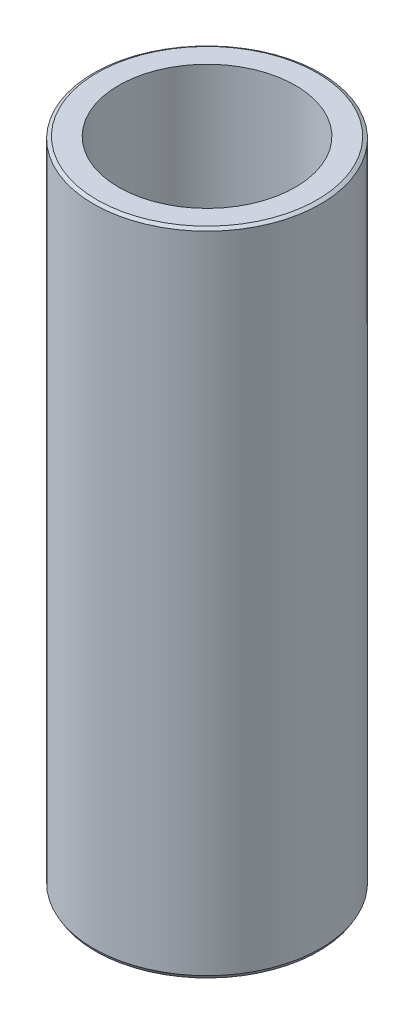
ISO-10303-21;
HEADER;
FILE_DESCRIPTION(('STEP AP214'),'2;1');
FILE_NAME('part.step','',(''),(''),'','','');
FILE_SCHEMA(('AUTOMOTIVE_DESIGN { 1 0 10303 214 1 1 1 1 }'));
ENDSEC;
DATA;
#1=APPLICATION_CONTEXT('core data for automotive mechanical design processes');
#2=APPLICATION_PROTOCOL_DEFINITION('international standard','automotive_design',2000,#1);
#3=PRODUCT_CONTEXT('',#1,'mechanical');
#4=PRODUCT('Part','Part','',(#3));
#5=PRODUCT_RELATED_PRODUCT_CATEGORY('part','',(#4));
#6=PRODUCT_DEFINITION_FORMATION('','',#4);
#7=PRODUCT_DEFINITION_CONTEXT('part definition',#1,'design');
#8=PRODUCT_DEFINITION('design','',#6,#7);
#9=PRODUCT_DEFINITION_SHAPE('','',#8);
#10=(LENGTH_UNIT() NAMED_UNIT(*) SI_UNIT(.MILLI.,.METRE.));
#11=(NAMED_UNIT(*) PLANE_ANGLE_UNIT() SI_UNIT($,.RADIAN.));
#12=(NAMED_UNIT(*) SI_UNIT($,.STERADIAN.) SOLID_ANGLE_UNIT());
#13=UNCERTAINTY_MEASURE_WITH_UNIT(LENGTH_MEASURE(1.E-05),#10,'distance_accuracy_value','');
#14=(GEOMETRIC_REPRESENTATION_CONTEXT(3) GLOBAL_UNCERTAINTY_ASSIGNED_CONTEXT((#13)) GLOBAL_UNIT_ASSIGNED_CONTEXT((#10,
#11,#12)) REPRESENTATION_CONTEXT('',''));
#15=CARTESIAN_POINT('',(0.,0.,0.));
#16=DIRECTION('',(0.,0.,1.));
#17=DIRECTION('',(1.,0.,0.));
#18=AXIS2_PLACEMENT_3D('',#15,#16,#17);
#19=CARTESIAN_POINT('',(0.,100.26764990413,0.));
#20=DIRECTION('',(0.,-1.,0.));
#21=DIRECTION('',(0.,0.,-1.));
#22=AXIS2_PLACEMENT_3D('',#19,#20,#21);
#23=CYLINDRICAL_SURFACE('',#22,17.5);
#24=CARTESIAN_POINT('',(0.,99.96493620214,0.));
#25=DIRECTION('',(0.,1.,0.));
#26=DIRECTION('',(0.,0.,1.));
#27=AXIS2_PLACEMENT_3D('',#24,#25,#26);
#28=CIRCLE('',#27,17.5);
#29=CARTESIAN_POINT('',(0.,99.96493620214,17.5));
#30=VERTEX_POINT('',#29);
#31=EDGE_CURVE('E50',#30,#30,#28,.F.);
#32=ORIENTED_EDGE('',*,*,#31,.T.);
#33=EDGE_LOOP('',(#32));
#34=FACE_BOUND('',#33,.T.);
#35=CARTESIAN_POINT('',(0.,0.52431551199375,0.));
#36=DIRECTION('',(0.,1.,0.));
#37=DIRECTION('',(0.,0.,1.));
#38=AXIS2_PLACEMENT_3D('',#35,#36,#37);
#39=CIRCLE('',#38,17.5);
#40=CARTESIAN_POINT('',(0.,0.52431551199375,17.5));
#41=VERTEX_POINT('',#40);
#42=EDGE_CURVE('E51',#41,#41,#39,.T.);
#43=ORIENTED_EDGE('',*,*,#42,.T.);
#44=EDGE_LOOP('',(#43));
#45=FACE_BOUND('',#44,.T.);
#46=ADVANCED_FACE('F39',(#34,#45),#23,.T.);
#47=CARTESIAN_POINT('',(0.,100.26764990413,0.));
#48=DIRECTION('',(0.,1.,0.));
#49=DIRECTION('',(0.,0.,1.));
#50=AXIS2_PLACEMENT_3D('',#47,#48,#49);
#51=PLANE('',#50);
#52=CARTESIAN_POINT('',(0.,100.26764990413,0.));
#53=DIRECTION('',(0.,1.,0.));
#54=DIRECTION('',(0.,0.,1.));
#55=AXIS2_PLACEMENT_3D('',#52,#53,#54);
#56=CIRCLE('',#55,16.9756844880063);
#57=CARTESIAN_POINT('',(0.,100.26764990413,16.9756844880063));
#58=VERTEX_POINT('',#57);
#59=EDGE_CURVE('E54',#58,#58,#56,.T.);
#60=ORIENTED_EDGE('',*,*,#59,.T.);
#61=EDGE_LOOP('',(#60));
#62=FACE_BOUND('',#61,.T.);
#63=CARTESIAN_POINT('',(0.,100.26764990413,0.));
#64=DIRECTION('',(0.,1.,0.));
#65=DIRECTION('',(0.,0.,1.));
#66=AXIS2_PLACEMENT_3D('',#63,#64,#65);
#67=CIRCLE('',#66,13.621903189217);
#68=CARTESIAN_POINT('',(0.,100.26764990413,13.621903189217));
#69=VERTEX_POINT('',#68);
#70=EDGE_CURVE('E58',#69,#69,#67,.T.);
#71=ORIENTED_EDGE('',*,*,#70,.F.);
#72=EDGE_LOOP('',(#71));
#73=FACE_BOUND('',#72,.T.);
#74=ADVANCED_FACE('F69',(#62,#73),#51,.T.);
#75=CARTESIAN_POINT('',(0.,0.,0.));
#76=DIRECTION('',(0.,1.,0.));
#77=DIRECTION('',(0.,0.,1.));
#78=AXIS2_PLACEMENT_3D('',#75,#76,#77);
#79=PLANE('',#78);
#80=CARTESIAN_POINT('',(0.,0.,0.));
#81=DIRECTION('',(0.,1.,0.));
#82=DIRECTION('',(0.,0.,1.));
#83=AXIS2_PLACEMENT_3D('',#80,#81,#82);
#84=CIRCLE('',#83,17.1972862980101);
#85=CARTESIAN_POINT('',(0.,0.,17.1972862980101));
#86=VERTEX_POINT('',#85);
#87=EDGE_CURVE('E10',#86,#86,#84,.F.);
#88=ORIENTED_EDGE('',*,*,#87,.T.);
#89=EDGE_LOOP('',(#88));
#90=FACE_BOUND('',#89,.T.);
#91=CARTESIAN_POINT('',(0.,0.,0.));
#92=DIRECTION('',(0.,1.,0.));
#93=DIRECTION('',(0.,0.,1.));
#94=AXIS2_PLACEMENT_3D('',#91,#92,#93);
#95=CIRCLE('',#94,13.621903189217);
#96=CARTESIAN_POINT('',(0.,0.,13.621903189217));
#97=VERTEX_POINT('',#96);
#98=EDGE_CURVE('E63',#97,#97,#95,.T.);
#99=ORIENTED_EDGE('',*,*,#98,.T.);
#100=EDGE_LOOP('',(#99));
#101=FACE_BOUND('',#100,.T.);
#102=ADVANCED_FACE('F75',(#90,#101),#79,.F.);
#103=CARTESIAN_POINT('',(0.,100.26764990413,0.));
#104=DIRECTION('',(0.,-1.,0.));
#105=DIRECTION('',(0.,0.,-1.));
#106=AXIS2_PLACEMENT_3D('',#103,#104,#105);
#107=CYLINDRICAL_SURFACE('',#106,13.621903189217);
#108=ORIENTED_EDGE('',*,*,#70,.T.);
#109=EDGE_LOOP('',(#108));
#110=FACE_BOUND('',#109,.T.);
#111=ORIENTED_EDGE('',*,*,#98,.F.);
#112=EDGE_LOOP('',(#111));
#113=FACE_BOUND('',#112,.T.);
#114=ADVANCED_FACE('F70',(#110,#113),#107,.F.);
#115=CARTESIAN_POINT('',(0.,100.26764990413,0.));
#116=DIRECTION('',(0.,-1.,0.));
#117=DIRECTION('',(0.,0.,-1.));
#118=AXIS2_PLACEMENT_3D('',#115,#116,#117);
#119=CONICAL_SURFACE('',#118,16.9756844880063,1.0471975511966);
#120=ORIENTED_EDGE('',*,*,#31,.F.);
#121=EDGE_LOOP('',(#120));
#122=FACE_BOUND('',#121,.T.);
#123=ORIENTED_EDGE('',*,*,#59,.F.);
#124=EDGE_LOOP('',(#123));
#125=FACE_BOUND('',#124,.T.);
#126=ADVANCED_FACE('F81',(#122,#125),#119,.T.);
#127=CARTESIAN_POINT('',(0.,0.52431551199375,0.));
#128=DIRECTION('',(0.,1.,0.));
#129=DIRECTION('',(0.,0.,1.));
#130=AXIS2_PLACEMENT_3D('',#127,#128,#129);
#131=CONICAL_SURFACE('',#130,17.5,0.523598775598301);
#132=ORIENTED_EDGE('',*,*,#87,.F.);
#133=EDGE_LOOP('',(#132));
#134=FACE_BOUND('',#133,.T.);
#135=ORIENTED_EDGE('',*,*,#42,.F.);
#136=EDGE_LOOP('',(#135));
#137=FACE_BOUND('',#136,.T.);
#138=ADVANCED_FACE('F45',(#134,#137),#131,.T.);
#139=CLOSED_SHELL('',(#46,#74,#102,#114,#126,#138));
#140=MANIFOLD_SOLID_BREP('B2',#139);
#141=ADVANCED_BREP_SHAPE_REPRESENTATION('',(#18,#140),#14);
#142=SHAPE_DEFINITION_REPRESENTATION(#9,#141);
ENDSEC;
END-ISO-10303-21;
